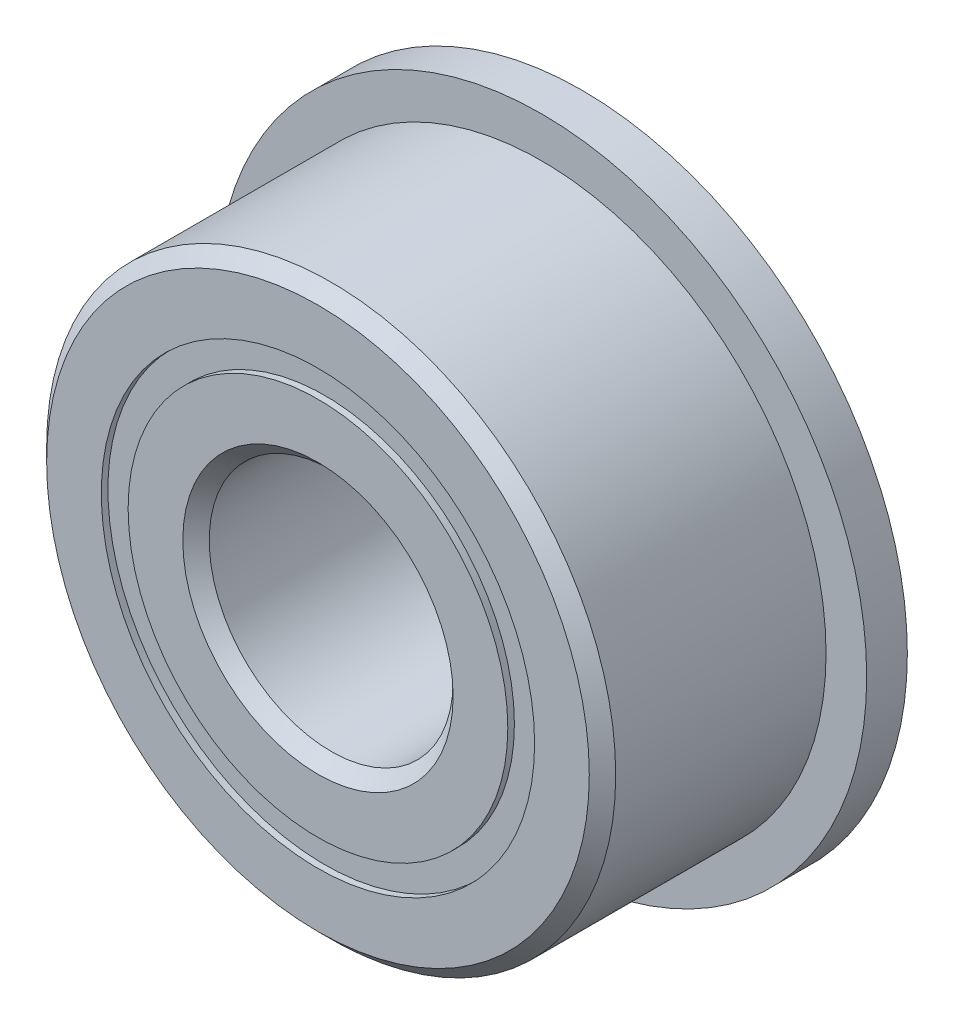
ISO-10303-21;
HEADER;
FILE_DESCRIPTION(('STEP AP214'),'2;1');
FILE_NAME('part.step','',(''),(''),'','','');
FILE_SCHEMA(('AUTOMOTIVE_DESIGN { 1 0 10303 214 1 1 1 1 }'));
ENDSEC;
DATA;
#1=APPLICATION_CONTEXT('core data for automotive mechanical design processes');
#2=APPLICATION_PROTOCOL_DEFINITION('international standard','automotive_design',2000,#1);
#3=PRODUCT_CONTEXT('',#1,'mechanical');
#4=PRODUCT('Part','Part','',(#3));
#5=PRODUCT_RELATED_PRODUCT_CATEGORY('part','',(#4));
#6=PRODUCT_DEFINITION_FORMATION('','',#4);
#7=PRODUCT_DEFINITION_CONTEXT('part definition',#1,'design');
#8=PRODUCT_DEFINITION('design','',#6,#7);
#9=PRODUCT_DEFINITION_SHAPE('','',#8);
#10=(LENGTH_UNIT() NAMED_UNIT(*) SI_UNIT(.MILLI.,.METRE.));
#11=(NAMED_UNIT(*) PLANE_ANGLE_UNIT() SI_UNIT($,.RADIAN.));
#12=(NAMED_UNIT(*) SI_UNIT($,.STERADIAN.) SOLID_ANGLE_UNIT());
#13=UNCERTAINTY_MEASURE_WITH_UNIT(LENGTH_MEASURE(1.E-05),#10,'distance_accuracy_value','');
#14=(GEOMETRIC_REPRESENTATION_CONTEXT(3) GLOBAL_UNCERTAINTY_ASSIGNED_CONTEXT((#13)) GLOBAL_UNIT_ASSIGNED_CONTEXT((#10,
#11,#12)) REPRESENTATION_CONTEXT('',''));
#15=CARTESIAN_POINT('',(0.,0.,0.));
#16=DIRECTION('',(0.,0.,1.));
#17=DIRECTION('',(1.,0.,0.));
#18=AXIS2_PLACEMENT_3D('',#15,#16,#17);
#19=CARTESIAN_POINT('',(0.,8.46085164835165,-4.90140625));
#20=DIRECTION('',(0.,0.,1.));
#21=DIRECTION('',(1.,0.,0.));
#22=AXIS2_PLACEMENT_3D('',#19,#20,#21);
#23=PLANE('',#22);
#24=CARTESIAN_POINT('',(0.,0.,-4.90140625));
#25=DIRECTION('',(0.,0.,1.));
#26=DIRECTION('',(1.,0.,0.));
#27=AXIS2_PLACEMENT_3D('',#24,#25,#26);
#28=CIRCLE('',#27,8.46085164835165);
#29=CARTESIAN_POINT('',(8.46085164835165,0.,-4.90140625));
#30=VERTEX_POINT('',#29);
#31=EDGE_CURVE('E56',#30,#30,#28,.T.);
#32=ORIENTED_EDGE('',*,*,#31,.F.);
#33=EDGE_LOOP('',(#32));
#34=FACE_BOUND('',#33,.T.);
#35=CARTESIAN_POINT('',(0.,0.,-4.90140625));
#36=DIRECTION('',(0.,0.,1.));
#37=DIRECTION('',(1.,0.,0.));
#38=AXIS2_PLACEMENT_3D('',#35,#36,#37);
#39=CIRCLE('',#38,7.41414835164835);
#40=CARTESIAN_POINT('',(7.41414835164835,0.,-4.90140625));
#41=VERTEX_POINT('',#40);
#42=EDGE_CURVE('E11',#41,#41,#39,.T.);
#43=ORIENTED_EDGE('',*,*,#42,.T.);
#44=EDGE_LOOP('',(#43));
#45=FACE_BOUND('',#44,.T.);
#46=ADVANCED_FACE('F42',(#34,#45),#23,.F.);
#47=CARTESIAN_POINT('',(0.,0.,5.159375));
#48=DIRECTION('',(0.,0.,1.));
#49=DIRECTION('',(1.,0.,0.));
#50=AXIS2_PLACEMENT_3D('',#47,#48,#49);
#51=CYLINDRICAL_SURFACE('',#50,7.41414835164835);
#52=ORIENTED_EDGE('',*,*,#42,.F.);
#53=EDGE_LOOP('',(#52));
#54=FACE_BOUND('',#53,.T.);
#55=CARTESIAN_POINT('',(0.,0.,-2.35202056298337));
#56=DIRECTION('',(0.,0.,1.));
#57=DIRECTION('',(1.,0.,0.));
#58=AXIS2_PLACEMENT_3D('',#55,#56,#57);
#59=CIRCLE('',#58,7.41414835164835);
#60=CARTESIAN_POINT('',(7.41414835164835,0.,-2.35202056298337));
#61=VERTEX_POINT('',#60);
#62=EDGE_CURVE('E48',#61,#61,#59,.T.);
#63=ORIENTED_EDGE('',*,*,#62,.T.);
#64=EDGE_LOOP('',(#63));
#65=FACE_BOUND('',#64,.T.);
#66=ADVANCED_FACE('F65',(#54,#65),#51,.F.);
#67=CARTESIAN_POINT('',(0.,8.46085164835165,-2.35202056298336));
#68=DIRECTION('',(0.,0.,-1.));
#69=DIRECTION('',(-1.,0.,0.));
#70=AXIS2_PLACEMENT_3D('',#67,#68,#69);
#71=PLANE('',#70);
#72=ORIENTED_EDGE('',*,*,#62,.F.);
#73=EDGE_LOOP('',(#72));
#74=FACE_BOUND('',#73,.T.);
#75=CARTESIAN_POINT('',(0.,0.,-2.35202056298337));
#76=DIRECTION('',(0.,0.,1.));
#77=DIRECTION('',(1.,0.,0.));
#78=AXIS2_PLACEMENT_3D('',#75,#76,#77);
#79=CIRCLE('',#78,8.46085164835165);
#80=CARTESIAN_POINT('',(8.46085164835165,0.,-2.35202056298337));
#81=VERTEX_POINT('',#80);
#82=EDGE_CURVE('E52',#81,#81,#79,.T.);
#83=ORIENTED_EDGE('',*,*,#82,.T.);
#84=EDGE_LOOP('',(#83));
#85=FACE_BOUND('',#84,.T.);
#86=ADVANCED_FACE('F69',(#74,#85),#71,.F.);
#87=CARTESIAN_POINT('',(0.,0.,5.159375));
#88=DIRECTION('',(0.,0.,1.));
#89=DIRECTION('',(1.,0.,0.));
#90=AXIS2_PLACEMENT_3D('',#87,#88,#89);
#91=CYLINDRICAL_SURFACE('',#90,8.46085164835165);
#92=ORIENTED_EDGE('',*,*,#82,.F.);
#93=EDGE_LOOP('',(#92));
#94=FACE_BOUND('',#93,.T.);
#95=ORIENTED_EDGE('',*,*,#31,.T.);
#96=EDGE_LOOP('',(#95));
#97=FACE_BOUND('',#96,.T.);
#98=ADVANCED_FACE('F62',(#94,#97),#91,.T.);
#99=CLOSED_SHELL('',(#46,#66,#86,#98));
#100=MANIFOLD_SOLID_BREP('B2',#99);
#101=CARTESIAN_POINT('',(0.,8.46085164835165,4.90140625));
#102=DIRECTION('',(0.,0.,-1.));
#103=DIRECTION('',(-1.,0.,0.));
#104=AXIS2_PLACEMENT_3D('',#101,#102,#103);
#105=PLANE('',#104);
#106=CARTESIAN_POINT('',(0.,0.,4.90140625));
#107=DIRECTION('',(0.,0.,1.));
#108=DIRECTION('',(1.,0.,0.));
#109=AXIS2_PLACEMENT_3D('',#106,#107,#108);
#110=CIRCLE('',#109,7.41414835164835);
#111=CARTESIAN_POINT('',(7.41414835164835,0.,4.90140625));
#112=VERTEX_POINT('',#111);
#113=EDGE_CURVE('E41',#112,#112,#110,.T.);
#114=ORIENTED_EDGE('',*,*,#113,.F.);
#115=EDGE_LOOP('',(#114));
#116=FACE_BOUND('',#115,.T.);
#117=CARTESIAN_POINT('',(0.,0.,4.90140625));
#118=DIRECTION('',(0.,0.,1.));
#119=DIRECTION('',(1.,0.,0.));
#120=AXIS2_PLACEMENT_3D('',#117,#118,#119);
#121=CIRCLE('',#120,8.46085164835165);
#122=CARTESIAN_POINT('',(8.46085164835165,0.,4.90140625));
#123=VERTEX_POINT('',#122);
#124=EDGE_CURVE('E124',#123,#123,#121,.T.);
#125=ORIENTED_EDGE('',*,*,#124,.T.);
#126=EDGE_LOOP('',(#125));
#127=FACE_BOUND('',#126,.T.);
#128=ADVANCED_FACE('F110',(#116,#127),#105,.F.);
#129=CARTESIAN_POINT('',(0.,0.,5.159375));
#130=DIRECTION('',(0.,0.,1.));
#131=DIRECTION('',(1.,0.,0.));
#132=AXIS2_PLACEMENT_3D('',#129,#130,#131);
#133=CYLINDRICAL_SURFACE('',#132,7.41414835164835);
#134=CARTESIAN_POINT('',(0.,0.,2.35202056298336));
#135=DIRECTION('',(0.,0.,1.));
#136=DIRECTION('',(1.,0.,0.));
#137=AXIS2_PLACEMENT_3D('',#134,#135,#136);
#138=CIRCLE('',#137,7.41414835164835);
#139=CARTESIAN_POINT('',(7.41414835164835,0.,2.35202056298336));
#140=VERTEX_POINT('',#139);
#141=EDGE_CURVE('E116',#140,#140,#138,.T.);
#142=ORIENTED_EDGE('',*,*,#141,.F.);
#143=EDGE_LOOP('',(#142));
#144=FACE_BOUND('',#143,.T.);
#145=ORIENTED_EDGE('',*,*,#113,.T.);
#146=EDGE_LOOP('',(#145));
#147=FACE_BOUND('',#146,.T.);
#148=ADVANCED_FACE('F139',(#144,#147),#133,.F.);
#149=CARTESIAN_POINT('',(0.,8.46085164835165,2.35202056298336));
#150=DIRECTION('',(0.,0.,1.));
#151=DIRECTION('',(1.,0.,0.));
#152=AXIS2_PLACEMENT_3D('',#149,#150,#151);
#153=PLANE('',#152);
#154=CARTESIAN_POINT('',(0.,0.,2.35202056298336));
#155=DIRECTION('',(0.,0.,1.));
#156=DIRECTION('',(1.,0.,0.));
#157=AXIS2_PLACEMENT_3D('',#154,#155,#156);
#158=CIRCLE('',#157,8.46085164835165);
#159=CARTESIAN_POINT('',(8.46085164835165,0.,2.35202056298336));
#160=VERTEX_POINT('',#159);
#161=EDGE_CURVE('E120',#160,#160,#158,.T.);
#162=ORIENTED_EDGE('',*,*,#161,.F.);
#163=EDGE_LOOP('',(#162));
#164=FACE_BOUND('',#163,.T.);
#165=ORIENTED_EDGE('',*,*,#141,.T.);
#166=EDGE_LOOP('',(#165));
#167=FACE_BOUND('',#166,.T.);
#168=ADVANCED_FACE('F134',(#164,#167),#153,.F.);
#169=CARTESIAN_POINT('',(0.,0.,5.159375));
#170=DIRECTION('',(0.,0.,1.));
#171=DIRECTION('',(1.,0.,0.));
#172=AXIS2_PLACEMENT_3D('',#169,#170,#171);
#173=CYLINDRICAL_SURFACE('',#172,8.46085164835165);
#174=ORIENTED_EDGE('',*,*,#124,.F.);
#175=EDGE_LOOP('',(#174));
#176=FACE_BOUND('',#175,.T.);
#177=ORIENTED_EDGE('',*,*,#161,.T.);
#178=EDGE_LOOP('',(#177));
#179=FACE_BOUND('',#178,.T.);
#180=ADVANCED_FACE('F131',(#176,#179),#173,.T.);
#181=CLOSED_SHELL('',(#128,#148,#168,#180));
#182=MANIFOLD_SOLID_BREP('B6',#181);
#183=CARTESIAN_POINT('',(-3.96874999999991,6.87407664253903,0.));
#184=DIRECTION('',(0.,0.,1.));
#185=DIRECTION('',(-0.499999999999989,0.866025403784445,0.));
#186=AXIS2_PLACEMENT_3D('',#183,#184,#185);
#187=SPHERICAL_SURFACE('',#186,2.35202056298336);
#188=CARTESIAN_POINT('',(-3.96874999999991,6.87407664253903,2.35202056298336));
#189=VERTEX_POINT('',#188);
#190=VERTEX_LOOP('',#189);
#191=FACE_BOUND('',#190,.T.);
#192=ADVANCED_FACE('F178',(#191),#187,.T.);
#193=CLOSED_SHELL('',(#192));
#194=MANIFOLD_SOLID_BREP('B36',#193);
#195=CARTESIAN_POINT('',(-6.87407664253894,3.96875000000008,0.));
#196=DIRECTION('',(0.,0.,1.));
#197=DIRECTION('',(-0.866025403784433,0.50000000000001,0.));
#198=AXIS2_PLACEMENT_3D('',#195,#196,#197);
#199=SPHERICAL_SURFACE('',#198,2.35202056298336);
#200=CARTESIAN_POINT('',(-6.87407664253894,3.96875000000008,2.35202056298336));
#201=VERTEX_POINT('',#200);
#202=VERTEX_LOOP('',#201);
#203=FACE_BOUND('',#202,.T.);
#204=ADVANCED_FACE('F199',(#203),#199,.T.);
#205=CLOSED_SHELL('',(#204));
#206=MANIFOLD_SOLID_BREP('B106',#205);
#207=CARTESIAN_POINT('',(-7.9375,0.,0.));
#208=DIRECTION('',(0.,0.,1.));
#209=DIRECTION('',(-1.,0.,0.));
#210=AXIS2_PLACEMENT_3D('',#207,#208,#209);
#211=SPHERICAL_SURFACE('',#210,2.35202056298336);
#212=CARTESIAN_POINT('',(-7.9375,0.,2.35202056298336));
#213=VERTEX_POINT('',#212);
#214=VERTEX_LOOP('',#213);
#215=FACE_BOUND('',#214,.T.);
#216=ADVANCED_FACE('F220',(#215),#211,.T.);
#217=CLOSED_SHELL('',(#216));
#218=MANIFOLD_SOLID_BREP('B174',#217);
#219=CARTESIAN_POINT('',(-6.87407664253902,-3.96874999999994,0.));
#220=DIRECTION('',(0.,0.,1.));
#221=DIRECTION('',(-0.866025403784443,-0.499999999999992,0.));
#222=AXIS2_PLACEMENT_3D('',#219,#220,#221);
#223=SPHERICAL_SURFACE('',#222,2.35202056298336);
#224=CARTESIAN_POINT('',(-6.87407664253902,-3.96874999999994,2.35202056298336));
#225=VERTEX_POINT('',#224);
#226=VERTEX_LOOP('',#225);
#227=FACE_BOUND('',#226,.T.);
#228=ADVANCED_FACE('F241',(#227),#223,.T.);
#229=CLOSED_SHELL('',(#228));
#230=MANIFOLD_SOLID_BREP('B195',#229);
#231=CARTESIAN_POINT('',(-3.96875000000006,-6.87407664253895,0.));
#232=DIRECTION('',(0.,0.,1.));
#233=DIRECTION('',(-0.500000000000007,-0.866025403784435,0.));
#234=AXIS2_PLACEMENT_3D('',#231,#232,#233);
#235=SPHERICAL_SURFACE('',#234,2.35202056298336);
#236=CARTESIAN_POINT('',(-3.96875000000006,-6.87407664253895,2.35202056298336));
#237=VERTEX_POINT('',#236);
#238=VERTEX_LOOP('',#237);
#239=FACE_BOUND('',#238,.T.);
#240=ADVANCED_FACE('F262',(#239),#235,.T.);
#241=CLOSED_SHELL('',(#240));
#242=MANIFOLD_SOLID_BREP('B216',#241);
#243=CARTESIAN_POINT('',(0.,-7.9375,0.));
#244=DIRECTION('',(0.,0.,1.));
#245=DIRECTION('',(0.,-1.,0.));
#246=AXIS2_PLACEMENT_3D('',#243,#244,#245);
#247=SPHERICAL_SURFACE('',#246,2.35202056298336);
#248=CARTESIAN_POINT('',(0.,-7.9375,2.35202056298336));
#249=VERTEX_POINT('',#248);
#250=VERTEX_LOOP('',#249);
#251=FACE_BOUND('',#250,.T.);
#252=ADVANCED_FACE('F283',(#251),#247,.T.);
#253=CLOSED_SHELL('',(#252));
#254=MANIFOLD_SOLID_BREP('B237',#253);
#255=CARTESIAN_POINT('',(3.96874999999996,-6.87407664253901,0.));
#256=DIRECTION('',(0.,0.,1.));
#257=DIRECTION('',(0.499999999999995,-0.866025403784442,0.));
#258=AXIS2_PLACEMENT_3D('',#255,#256,#257);
#259=SPHERICAL_SURFACE('',#258,2.35202056298336);
#260=CARTESIAN_POINT('',(3.96874999999996,-6.87407664253901,2.35202056298336));
#261=VERTEX_POINT('',#260);
#262=VERTEX_LOOP('',#261);
#263=FACE_BOUND('',#262,.T.);
#264=ADVANCED_FACE('F304',(#263),#259,.T.);
#265=CLOSED_SHELL('',(#264));
#266=MANIFOLD_SOLID_BREP('B258',#265);
#267=CARTESIAN_POINT('',(6.87407664253896,-3.96875000000003,0.));
#268=DIRECTION('',(0.,0.,1.));
#269=DIRECTION('',(0.866025403784436,-0.500000000000004,0.));
#270=AXIS2_PLACEMENT_3D('',#267,#268,#269);
#271=SPHERICAL_SURFACE('',#270,2.35202056298336);
#272=CARTESIAN_POINT('',(6.87407664253896,-3.96875000000003,2.35202056298336));
#273=VERTEX_POINT('',#272);
#274=VERTEX_LOOP('',#273);
#275=FACE_BOUND('',#274,.T.);
#276=ADVANCED_FACE('F325',(#275),#271,.T.);
#277=CLOSED_SHELL('',(#276));
#278=MANIFOLD_SOLID_BREP('B279',#277);
#279=CARTESIAN_POINT('',(7.9375,0.,0.));
#280=DIRECTION('',(0.,0.,1.));
#281=DIRECTION('',(1.,0.,0.));
#282=AXIS2_PLACEMENT_3D('',#279,#280,#281);
#283=SPHERICAL_SURFACE('',#282,2.35202056298336);
#284=CARTESIAN_POINT('',(7.9375,0.,2.35202056298336));
#285=VERTEX_POINT('',#284);
#286=VERTEX_LOOP('',#285);
#287=FACE_BOUND('',#286,.T.);
#288=ADVANCED_FACE('F346',(#287),#283,.T.);
#289=CLOSED_SHELL('',(#288));
#290=MANIFOLD_SOLID_BREP('B300',#289);
#291=CARTESIAN_POINT('',(6.87407664253899,3.96874999999998,0.));
#292=DIRECTION('',(0.,0.,1.));
#293=DIRECTION('',(0.86602540378444,0.499999999999998,0.));
#294=AXIS2_PLACEMENT_3D('',#291,#292,#293);
#295=SPHERICAL_SURFACE('',#294,2.35202056298336);
#296=CARTESIAN_POINT('',(6.87407664253899,3.96874999999998,2.35202056298336));
#297=VERTEX_POINT('',#296);
#298=VERTEX_LOOP('',#297);
#299=FACE_BOUND('',#298,.T.);
#300=ADVANCED_FACE('F367',(#299),#295,.T.);
#301=CLOSED_SHELL('',(#300));
#302=MANIFOLD_SOLID_BREP('B321',#301);
#303=CARTESIAN_POINT('',(3.96875000000001,6.87407664253898,0.));
#304=DIRECTION('',(0.,0.,1.));
#305=DIRECTION('',(0.500000000000001,0.866025403784438,0.));
#306=AXIS2_PLACEMENT_3D('',#303,#304,#305);
#307=SPHERICAL_SURFACE('',#306,2.35202056298336);
#308=CARTESIAN_POINT('',(3.96875000000001,6.87407664253898,2.35202056298336));
#309=VERTEX_POINT('',#308);
#310=VERTEX_LOOP('',#309);
#311=FACE_BOUND('',#310,.T.);
#312=ADVANCED_FACE('F388',(#311),#307,.T.);
#313=CLOSED_SHELL('',(#312));
#314=MANIFOLD_SOLID_BREP('B342',#313);
#315=CARTESIAN_POINT('',(0.,7.9375,0.));
#316=DIRECTION('',(0.,0.,1.));
#317=DIRECTION('',(0.,1.,0.));
#318=AXIS2_PLACEMENT_3D('',#315,#316,#317);
#319=SPHERICAL_SURFACE('',#318,2.35202056298336);
#320=CARTESIAN_POINT('',(0.,7.9375,2.35202056298336));
#321=VERTEX_POINT('',#320);
#322=VERTEX_LOOP('',#321);
#323=FACE_BOUND('',#322,.T.);
#324=ADVANCED_FACE('F411',(#323),#319,.T.);
#325=CLOSED_SHELL('',(#324));
#326=MANIFOLD_SOLID_BREP('B363',#325);
#327=CARTESIAN_POINT('',(0.,7.41414835164835,5.159375));
#328=DIRECTION('',(0.,0.,-1.));
#329=DIRECTION('',(-1.,0.,0.));
#330=AXIS2_PLACEMENT_3D('',#327,#328,#329);
#331=PLANE('',#330);
#332=CARTESIAN_POINT('',(0.,0.,5.159375));
#333=DIRECTION('',(0.,0.,1.));
#334=DIRECTION('',(1.,0.,0.));
#335=AXIS2_PLACEMENT_3D('',#332,#333,#334);
#336=CIRCLE('',#335,5.2784375);
#337=CARTESIAN_POINT('',(5.2784375,0.,5.159375));
#338=VERTEX_POINT('',#337);
#339=EDGE_CURVE('E459',#338,#338,#336,.T.);
#340=ORIENTED_EDGE('',*,*,#339,.F.);
#341=EDGE_LOOP('',(#340));
#342=FACE_BOUND('',#341,.T.);
#343=CARTESIAN_POINT('',(0.,0.,5.159375));
#344=DIRECTION('',(0.,0.,1.));
#345=DIRECTION('',(1.,0.,0.));
#346=AXIS2_PLACEMENT_3D('',#343,#344,#345);
#347=CIRCLE('',#346,7.41414835164835);
#348=CARTESIAN_POINT('',(7.41414835164835,0.,5.159375));
#349=VERTEX_POINT('',#348);
#350=EDGE_CURVE('E410',#349,#349,#347,.T.);
#351=ORIENTED_EDGE('',*,*,#350,.T.);
#352=EDGE_LOOP('',(#351));
#353=FACE_BOUND('',#352,.T.);
#354=ADVANCED_FACE('F431',(#342,#353),#331,.F.);
#355=CARTESIAN_POINT('',(0.,0.,5.159375));
#356=DIRECTION('',(0.,0.,1.));
#357=DIRECTION('',(1.,0.,0.));
#358=AXIS2_PLACEMENT_3D('',#355,#356,#357);
#359=CYLINDRICAL_SURFACE('',#358,7.41414835164835);
#360=ORIENTED_EDGE('',*,*,#350,.F.);
#361=EDGE_LOOP('',(#360));
#362=FACE_BOUND('',#361,.T.);
#363=CARTESIAN_POINT('',(0.,0.,2.29305555555556));
#364=DIRECTION('',(0.,0.,1.));
#365=DIRECTION('',(1.,0.,0.));
#366=AXIS2_PLACEMENT_3D('',#363,#364,#365);
#367=CIRCLE('',#366,7.41414835164835);
#368=CARTESIAN_POINT('',(7.41414835164835,0.,2.29305555555556));
#369=VERTEX_POINT('',#368);
#370=EDGE_CURVE('E437',#369,#369,#367,.T.);
#371=ORIENTED_EDGE('',*,*,#370,.T.);
#372=EDGE_LOOP('',(#371));
#373=FACE_BOUND('',#372,.T.);
#374=ADVANCED_FACE('F466',(#362,#373),#359,.T.);
#375=CARTESIAN_POINT('',(0.,0.,0.));
#376=DIRECTION('',(0.,0.,1.));
#377=DIRECTION('',(1.,0.,0.));
#378=AXIS2_PLACEMENT_3D('',#375,#376,#377);
#379=TOROIDAL_SURFACE('',#378,7.93749999999999,2.35202056298336);
#380=ORIENTED_EDGE('',*,*,#370,.F.);
#381=EDGE_LOOP('',(#380));
#382=FACE_BOUND('',#381,.T.);
#383=CARTESIAN_POINT('',(0.,0.,-2.29305555555556));
#384=DIRECTION('',(0.,0.,1.));
#385=DIRECTION('',(1.,0.,0.));
#386=AXIS2_PLACEMENT_3D('',#383,#384,#385);
#387=CIRCLE('',#386,7.41414835164835);
#388=CARTESIAN_POINT('',(7.41414835164835,0.,-2.29305555555556));
#389=VERTEX_POINT('',#388);
#390=EDGE_CURVE('E441',#389,#389,#387,.T.);
#391=ORIENTED_EDGE('',*,*,#390,.T.);
#392=EDGE_LOOP('',(#391));
#393=FACE_BOUND('',#392,.T.);
#394=ADVANCED_FACE('F470',(#382,#393),#379,.F.);
#395=CARTESIAN_POINT('',(0.,0.,5.159375));
#396=DIRECTION('',(0.,0.,1.));
#397=DIRECTION('',(1.,0.,0.));
#398=AXIS2_PLACEMENT_3D('',#395,#396,#397);
#399=CYLINDRICAL_SURFACE('',#398,7.41414835164835);
#400=ORIENTED_EDGE('',*,*,#390,.F.);
#401=EDGE_LOOP('',(#400));
#402=FACE_BOUND('',#401,.T.);
#403=CARTESIAN_POINT('',(0.,0.,-5.159375));
#404=DIRECTION('',(0.,0.,1.));
#405=DIRECTION('',(1.,0.,0.));
#406=AXIS2_PLACEMENT_3D('',#403,#404,#405);
#407=CIRCLE('',#406,7.41414835164835);
#408=CARTESIAN_POINT('',(7.41414835164835,0.,-5.159375));
#409=VERTEX_POINT('',#408);
#410=EDGE_CURVE('E445',#409,#409,#407,.T.);
#411=ORIENTED_EDGE('',*,*,#410,.T.);
#412=EDGE_LOOP('',(#411));
#413=FACE_BOUND('',#412,.T.);
#414=ADVANCED_FACE('F475',(#402,#413),#399,.T.);
#415=CARTESIAN_POINT('',(0.,5.2784375,-5.159375));
#416=DIRECTION('',(0.,0.,1.));
#417=DIRECTION('',(1.,0.,0.));
#418=AXIS2_PLACEMENT_3D('',#415,#416,#417);
#419=PLANE('',#418);
#420=ORIENTED_EDGE('',*,*,#410,.F.);
#421=EDGE_LOOP('',(#420));
#422=FACE_BOUND('',#421,.T.);
#423=CARTESIAN_POINT('',(0.,0.,-5.159375));
#424=DIRECTION('',(0.,0.,1.));
#425=DIRECTION('',(1.,0.,0.));
#426=AXIS2_PLACEMENT_3D('',#423,#424,#425);
#427=CIRCLE('',#426,5.2784375);
#428=CARTESIAN_POINT('',(5.2784375,0.,-5.159375));
#429=VERTEX_POINT('',#428);
#430=EDGE_CURVE('E450',#429,#429,#427,.T.);
#431=ORIENTED_EDGE('',*,*,#430,.T.);
#432=EDGE_LOOP('',(#431));
#433=FACE_BOUND('',#432,.T.);
#434=ADVANCED_FACE('F481',(#422,#433),#419,.F.);
#435=CARTESIAN_POINT('',(0.,0.,-4.6434375));
#436=DIRECTION('',(0.,0.,-1.));
#437=DIRECTION('',(-1.,0.,0.));
#438=AXIS2_PLACEMENT_3D('',#435,#436,#437);
#439=CONICAL_SURFACE('',#438,4.7625,0.785398163397446);
#440=ORIENTED_EDGE('',*,*,#430,.F.);
#441=EDGE_LOOP('',(#440));
#442=FACE_BOUND('',#441,.T.);
#443=CARTESIAN_POINT('',(0.,0.,-4.6434375));
#444=DIRECTION('',(0.,0.,1.));
#445=DIRECTION('',(1.,0.,0.));
#446=AXIS2_PLACEMENT_3D('',#443,#444,#445);
#447=CIRCLE('',#446,4.7625);
#448=CARTESIAN_POINT('',(4.7625,0.,-4.6434375));
#449=VERTEX_POINT('',#448);
#450=EDGE_CURVE('E453',#449,#449,#447,.T.);
#451=ORIENTED_EDGE('',*,*,#450,.T.);
#452=EDGE_LOOP('',(#451));
#453=FACE_BOUND('',#452,.T.);
#454=ADVANCED_FACE('F485',(#442,#453),#439,.F.);
#455=CARTESIAN_POINT('',(0.,0.,5.159375));
#456=DIRECTION('',(0.,0.,1.));
#457=DIRECTION('',(1.,0.,0.));
#458=AXIS2_PLACEMENT_3D('',#455,#456,#457);
#459=CYLINDRICAL_SURFACE('',#458,4.7625);
#460=ORIENTED_EDGE('',*,*,#450,.F.);
#461=EDGE_LOOP('',(#460));
#462=FACE_BOUND('',#461,.T.);
#463=CARTESIAN_POINT('',(0.,0.,4.6434375));
#464=DIRECTION('',(0.,0.,1.));
#465=DIRECTION('',(1.,0.,0.));
#466=AXIS2_PLACEMENT_3D('',#463,#464,#465);
#467=CIRCLE('',#466,4.7625);
#468=CARTESIAN_POINT('',(4.7625,0.,4.6434375));
#469=VERTEX_POINT('',#468);
#470=EDGE_CURVE('E456',#469,#469,#467,.T.);
#471=ORIENTED_EDGE('',*,*,#470,.T.);
#472=EDGE_LOOP('',(#471));
#473=FACE_BOUND('',#472,.T.);
#474=ADVANCED_FACE('F489',(#462,#473),#459,.F.);
#475=CARTESIAN_POINT('',(0.,0.,5.159375));
#476=DIRECTION('',(0.,0.,1.));
#477=DIRECTION('',(1.,0.,0.));
#478=AXIS2_PLACEMENT_3D('',#475,#476,#477);
#479=CONICAL_SURFACE('',#478,5.2784375,0.785398163397452);
#480=ORIENTED_EDGE('',*,*,#470,.F.);
#481=EDGE_LOOP('',(#480));
#482=FACE_BOUND('',#481,.T.);
#483=ORIENTED_EDGE('',*,*,#339,.T.);
#484=EDGE_LOOP('',(#483));
#485=FACE_BOUND('',#484,.T.);
#486=ADVANCED_FACE('F463',(#482,#485),#479,.F.);
#487=CLOSED_SHELL('',(#354,#374,#394,#414,#434,#454,#474,#486));
#488=MANIFOLD_SOLID_BREP('B384',#487);
#489=CARTESIAN_POINT('',(0.,0.,4.6434375));
#490=DIRECTION('',(0.,0.,-1.));
#491=DIRECTION('',(-1.,0.,0.));
#492=AXIS2_PLACEMENT_3D('',#489,#490,#491);
#493=CONICAL_SURFACE('',#492,11.1125,0.785398163397448);
#494=CARTESIAN_POINT('',(0.,0.,5.159375));
#495=DIRECTION('',(0.,0.,1.));
#496=DIRECTION('',(1.,0.,0.));
#497=AXIS2_PLACEMENT_3D('',#494,#495,#496);
#498=CIRCLE('',#497,10.5965625);
#499=CARTESIAN_POINT('',(10.5965625,0.,5.159375));
#500=VERTEX_POINT('',#499);
#501=EDGE_CURVE('E575',#500,#500,#498,.T.);
#502=ORIENTED_EDGE('',*,*,#501,.F.);
#503=EDGE_LOOP('',(#502));
#504=FACE_BOUND('',#503,.T.);
#505=CARTESIAN_POINT('',(0.,0.,4.6434375));
#506=DIRECTION('',(0.,0.,1.));
#507=DIRECTION('',(1.,0.,0.));
#508=AXIS2_PLACEMENT_3D('',#505,#506,#507);
#509=CIRCLE('',#508,11.1125);
#510=CARTESIAN_POINT('',(11.1125,0.,4.6434375));
#511=VERTEX_POINT('',#510);
#512=EDGE_CURVE('E430',#511,#511,#509,.T.);
#513=ORIENTED_EDGE('',*,*,#512,.T.);
#514=EDGE_LOOP('',(#513));
#515=FACE_BOUND('',#514,.T.);
#516=ADVANCED_FACE('F553',(#504,#515),#493,.T.);
#517=CARTESIAN_POINT('',(0.,0.,5.159375));
#518=DIRECTION('',(0.,0.,1.));
#519=DIRECTION('',(1.,0.,0.));
#520=AXIS2_PLACEMENT_3D('',#517,#518,#519);
#521=CYLINDRICAL_SURFACE('',#520,11.1125);
#522=CARTESIAN_POINT('',(0.,0.,-3.571875));
#523=DIRECTION('',(0.,0.,1.));
#524=DIRECTION('',(1.,0.,0.));
#525=AXIS2_PLACEMENT_3D('',#522,#523,#524);
#526=CIRCLE('',#525,11.1125);
#527=CARTESIAN_POINT('',(11.1125,0.,-3.571875));
#528=VERTEX_POINT('',#527);
#529=EDGE_CURVE('E578',#528,#528,#526,.T.);
#530=ORIENTED_EDGE('',*,*,#529,.T.);
#531=EDGE_LOOP('',(#530));
#532=FACE_BOUND('',#531,.T.);
#533=ORIENTED_EDGE('',*,*,#512,.F.);
#534=EDGE_LOOP('',(#533));
#535=FACE_BOUND('',#534,.T.);
#536=ADVANCED_FACE('F598',(#532,#535),#521,.T.);
#537=CARTESIAN_POINT('',(0.,10.5965625,-5.159375));
#538=DIRECTION('',(0.,0.,1.));
#539=DIRECTION('',(1.,0.,0.));
#540=AXIS2_PLACEMENT_3D('',#537,#538,#539);
#541=PLANE('',#540);
#542=CARTESIAN_POINT('',(0.,0.,-5.159375));
#543=DIRECTION('',(0.,0.,1.));
#544=DIRECTION('',(1.,0.,0.));
#545=AXIS2_PLACEMENT_3D('',#542,#543,#544);
#546=CIRCLE('',#545,8.46085164835165);
#547=CARTESIAN_POINT('',(8.46085164835165,0.,-5.159375));
#548=VERTEX_POINT('',#547);
#549=EDGE_CURVE('E559',#548,#548,#546,.T.);
#550=ORIENTED_EDGE('',*,*,#549,.T.);
#551=EDGE_LOOP('',(#550));
#552=FACE_BOUND('',#551,.T.);
#553=CARTESIAN_POINT('',(0.,0.,-5.159375));
#554=DIRECTION('',(0.,0.,-1.));
#555=DIRECTION('',(-1.,0.,0.));
#556=AXIS2_PLACEMENT_3D('',#553,#554,#555);
#557=CIRCLE('',#556,12.7);
#558=CARTESIAN_POINT('',(-12.7,0.,-5.159375));
#559=VERTEX_POINT('',#558);
#560=EDGE_CURVE('E581',#559,#559,#557,.T.);
#561=ORIENTED_EDGE('',*,*,#560,.T.);
#562=EDGE_LOOP('',(#561));
#563=FACE_BOUND('',#562,.T.);
#564=ADVANCED_FACE('F601',(#552,#563),#541,.F.);
#565=CARTESIAN_POINT('',(0.,0.,5.159375));
#566=DIRECTION('',(0.,0.,1.));
#567=DIRECTION('',(1.,0.,0.));
#568=AXIS2_PLACEMENT_3D('',#565,#566,#567);
#569=CYLINDRICAL_SURFACE('',#568,8.46085164835165);
#570=CARTESIAN_POINT('',(0.,0.,-2.29305555555556));
#571=DIRECTION('',(0.,0.,1.));
#572=DIRECTION('',(1.,0.,0.));
#573=AXIS2_PLACEMENT_3D('',#570,#571,#572);
#574=CIRCLE('',#573,8.46085164835165);
#575=CARTESIAN_POINT('',(8.46085164835165,0.,-2.29305555555556));
#576=VERTEX_POINT('',#575);
#577=EDGE_CURVE('E563',#576,#576,#574,.T.);
#578=ORIENTED_EDGE('',*,*,#577,.T.);
#579=EDGE_LOOP('',(#578));
#580=FACE_BOUND('',#579,.T.);
#581=ORIENTED_EDGE('',*,*,#549,.F.);
#582=EDGE_LOOP('',(#581));
#583=FACE_BOUND('',#582,.T.);
#584=ADVANCED_FACE('F606',(#580,#583),#569,.F.);
#585=CARTESIAN_POINT('',(0.,0.,0.));
#586=DIRECTION('',(0.,0.,1.));
#587=DIRECTION('',(1.,0.,0.));
#588=AXIS2_PLACEMENT_3D('',#585,#586,#587);
#589=TOROIDAL_SURFACE('',#588,7.9375,2.35202056298336);
#590=ORIENTED_EDGE('',*,*,#577,.F.);
#591=EDGE_LOOP('',(#590));
#592=FACE_BOUND('',#591,.T.);
#593=CARTESIAN_POINT('',(0.,0.,2.29305555555556));
#594=DIRECTION('',(0.,0.,1.));
#595=DIRECTION('',(1.,0.,0.));
#596=AXIS2_PLACEMENT_3D('',#593,#594,#595);
#597=CIRCLE('',#596,8.46085164835165);
#598=CARTESIAN_POINT('',(8.46085164835165,0.,2.29305555555556));
#599=VERTEX_POINT('',#598);
#600=EDGE_CURVE('E567',#599,#599,#597,.T.);
#601=ORIENTED_EDGE('',*,*,#600,.T.);
#602=EDGE_LOOP('',(#601));
#603=FACE_BOUND('',#602,.T.);
#604=ADVANCED_FACE('F612',(#592,#603),#589,.F.);
#605=CARTESIAN_POINT('',(0.,0.,5.159375));
#606=DIRECTION('',(0.,0.,1.));
#607=DIRECTION('',(1.,0.,0.));
#608=AXIS2_PLACEMENT_3D('',#605,#606,#607);
#609=CYLINDRICAL_SURFACE('',#608,8.46085164835165);
#610=ORIENTED_EDGE('',*,*,#600,.F.);
#611=EDGE_LOOP('',(#610));
#612=FACE_BOUND('',#611,.T.);
#613=CARTESIAN_POINT('',(0.,0.,5.159375));
#614=DIRECTION('',(0.,0.,1.));
#615=DIRECTION('',(1.,0.,0.));
#616=AXIS2_PLACEMENT_3D('',#613,#614,#615);
#617=CIRCLE('',#616,8.46085164835165);
#618=CARTESIAN_POINT('',(8.46085164835165,0.,5.159375));
#619=VERTEX_POINT('',#618);
#620=EDGE_CURVE('E572',#619,#619,#617,.T.);
#621=ORIENTED_EDGE('',*,*,#620,.T.);
#622=EDGE_LOOP('',(#621));
#623=FACE_BOUND('',#622,.T.);
#624=ADVANCED_FACE('F616',(#612,#623),#609,.F.);
#625=CARTESIAN_POINT('',(0.,10.5965625,5.159375));
#626=DIRECTION('',(0.,0.,-1.));
#627=DIRECTION('',(-1.,0.,0.));
#628=AXIS2_PLACEMENT_3D('',#625,#626,#627);
#629=PLANE('',#628);
#630=ORIENTED_EDGE('',*,*,#620,.F.);
#631=EDGE_LOOP('',(#630));
#632=FACE_BOUND('',#631,.T.);
#633=ORIENTED_EDGE('',*,*,#501,.T.);
#634=EDGE_LOOP('',(#633));
#635=FACE_BOUND('',#634,.T.);
#636=ADVANCED_FACE('F594',(#632,#635),#629,.F.);
#637=CARTESIAN_POINT('',(0.,8.46085164835165,-3.571875));
#638=DIRECTION('',(0.,0.,1.));
#639=DIRECTION('',(1.,0.,0.));
#640=AXIS2_PLACEMENT_3D('',#637,#638,#639);
#641=PLANE('',#640);
#642=CARTESIAN_POINT('',(0.,0.,-3.571875));
#643=DIRECTION('',(0.,0.,-1.));
#644=DIRECTION('',(-1.,0.,0.));
#645=AXIS2_PLACEMENT_3D('',#642,#643,#644);
#646=CIRCLE('',#645,12.7);
#647=CARTESIAN_POINT('',(-12.7,0.,-3.571875));
#648=VERTEX_POINT('',#647);
#649=EDGE_CURVE('E584',#648,#648,#646,.T.);
#650=ORIENTED_EDGE('',*,*,#649,.F.);
#651=EDGE_LOOP('',(#650));
#652=FACE_BOUND('',#651,.T.);
#653=ORIENTED_EDGE('',*,*,#529,.F.);
#654=EDGE_LOOP('',(#653));
#655=FACE_BOUND('',#654,.T.);
#656=ADVANCED_FACE('F591',(#652,#655),#641,.T.);
#657=CARTESIAN_POINT('',(0.,0.,-5.159375));
#658=DIRECTION('',(0.,0.,-1.));
#659=DIRECTION('',(-1.,0.,0.));
#660=AXIS2_PLACEMENT_3D('',#657,#658,#659);
#661=CYLINDRICAL_SURFACE('',#660,12.7);
#662=ORIENTED_EDGE('',*,*,#649,.T.);
#663=EDGE_LOOP('',(#662));
#664=FACE_BOUND('',#663,.T.);
#665=ORIENTED_EDGE('',*,*,#560,.F.);
#666=EDGE_LOOP('',(#665));
#667=FACE_BOUND('',#666,.T.);
#668=ADVANCED_FACE('F588',(#664,#667),#661,.T.);
#669=CLOSED_SHELL('',(#516,#536,#564,#584,#604,#624,#636,#656,#668));
#670=MANIFOLD_SOLID_BREP('B405',#669);
#671=ADVANCED_BREP_SHAPE_REPRESENTATION('',(#18,#100,#182,#194,#206,#218,#230,#242,#254,#266,
#278,#290,#302,#314,#326,#488,#670),#14);
#672=SHAPE_DEFINITION_REPRESENTATION(#9,#671);
ENDSEC;
END-ISO-10303-21;
